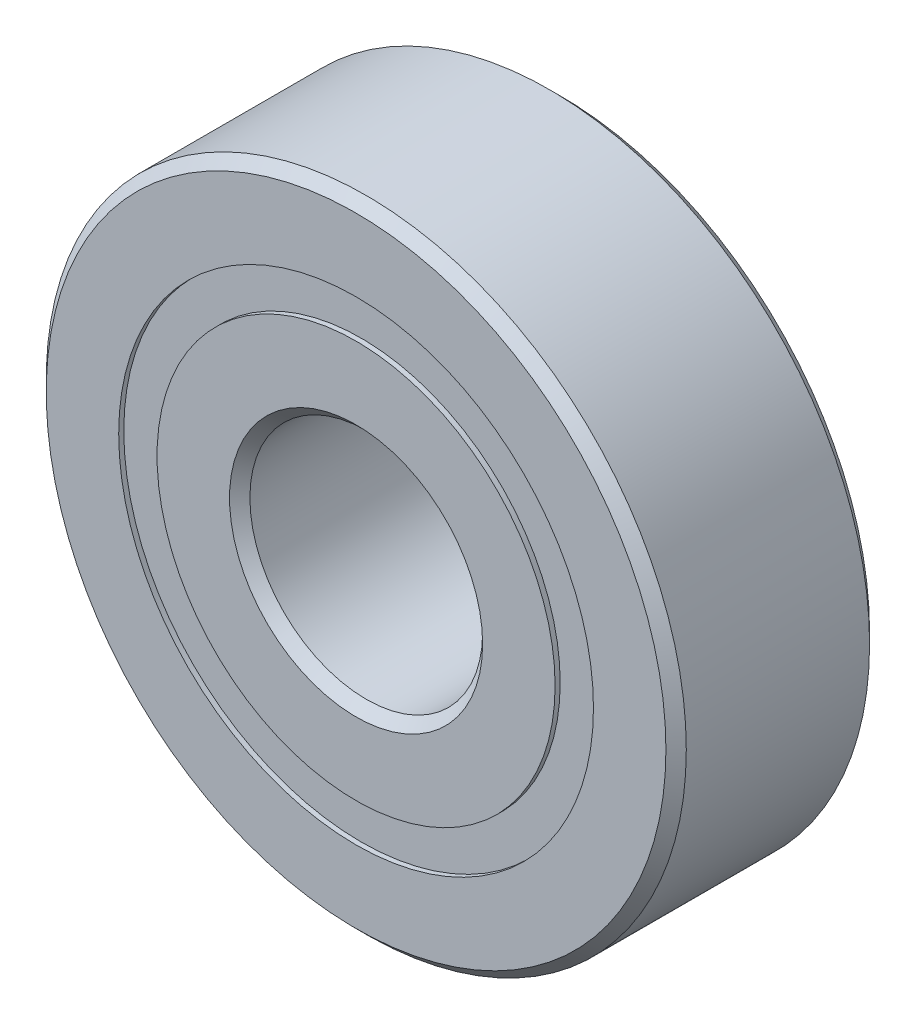
ISO-10303-21;
HEADER;
FILE_DESCRIPTION(('STEP AP214'),'2;1');
FILE_NAME('part.step','',(''),(''),'','','');
FILE_SCHEMA(('AUTOMOTIVE_DESIGN { 1 0 10303 214 1 1 1 1 }'));
ENDSEC;
DATA;
#1=APPLICATION_CONTEXT('core data for automotive mechanical design processes');
#2=APPLICATION_PROTOCOL_DEFINITION('international standard','automotive_design',2000,#1);
#3=PRODUCT_CONTEXT('',#1,'mechanical');
#4=PRODUCT('Part','Part','',(#3));
#5=PRODUCT_RELATED_PRODUCT_CATEGORY('part','',(#4));
#6=PRODUCT_DEFINITION_FORMATION('','',#4);
#7=PRODUCT_DEFINITION_CONTEXT('part definition',#1,'design');
#8=PRODUCT_DEFINITION('design','',#6,#7);
#9=PRODUCT_DEFINITION_SHAPE('','',#8);
#10=(LENGTH_UNIT() NAMED_UNIT(*) SI_UNIT(.MILLI.,.METRE.));
#11=(NAMED_UNIT(*) PLANE_ANGLE_UNIT() SI_UNIT($,.RADIAN.));
#12=(NAMED_UNIT(*) SI_UNIT($,.STERADIAN.) SOLID_ANGLE_UNIT());
#13=UNCERTAINTY_MEASURE_WITH_UNIT(LENGTH_MEASURE(1.E-05),#10,'distance_accuracy_value','');
#14=(GEOMETRIC_REPRESENTATION_CONTEXT(3) GLOBAL_UNCERTAINTY_ASSIGNED_CONTEXT((#13)) GLOBAL_UNIT_ASSIGNED_CONTEXT((#10,
#11,#12)) REPRESENTATION_CONTEXT('',''));
#15=CARTESIAN_POINT('',(0.,0.,0.));
#16=DIRECTION('',(0.,0.,1.));
#17=DIRECTION('',(1.,0.,0.));
#18=AXIS2_PLACEMENT_3D('',#15,#16,#17);
#19=CARTESIAN_POINT('',(0.,8.15934065934066,-3.325));
#20=DIRECTION('',(0.,0.,1.));
#21=DIRECTION('',(1.,0.,0.));
#22=AXIS2_PLACEMENT_3D('',#19,#20,#21);
#23=PLANE('',#22);
#24=CARTESIAN_POINT('',(0.,0.,-3.325));
#25=DIRECTION('',(0.,0.,1.));
#26=DIRECTION('',(1.,0.,0.));
#27=AXIS2_PLACEMENT_3D('',#24,#25,#26);
#28=CIRCLE('',#27,8.15934065934066);
#29=CARTESIAN_POINT('',(8.15934065934066,0.,-3.325));
#30=VERTEX_POINT('',#29);
#31=EDGE_CURVE('E58',#30,#30,#28,.T.);
#32=ORIENTED_EDGE('',*,*,#31,.F.);
#33=EDGE_LOOP('',(#32));
#34=FACE_BOUND('',#33,.T.);
#35=CARTESIAN_POINT('',(0.,0.,-3.325));
#36=DIRECTION('',(0.,0.,1.));
#37=DIRECTION('',(1.,0.,0.));
#38=AXIS2_PLACEMENT_3D('',#35,#36,#37);
#39=CIRCLE('',#38,6.84065934065934);
#40=CARTESIAN_POINT('',(6.84065934065934,0.,-3.325));
#41=VERTEX_POINT('',#40);
#42=EDGE_CURVE('E11',#41,#41,#39,.T.);
#43=ORIENTED_EDGE('',*,*,#42,.T.);
#44=EDGE_LOOP('',(#43));
#45=FACE_BOUND('',#44,.T.);
#46=ADVANCED_FACE('F44',(#34,#45),#23,.F.);
#47=CARTESIAN_POINT('',(0.,0.,3.5));
#48=DIRECTION('',(0.,0.,1.));
#49=DIRECTION('',(1.,0.,0.));
#50=AXIS2_PLACEMENT_3D('',#47,#48,#49);
#51=CYLINDRICAL_SURFACE('',#50,6.84065934065934);
#52=ORIENTED_EDGE('',*,*,#42,.F.);
#53=EDGE_LOOP('',(#52));
#54=FACE_BOUND('',#53,.T.);
#55=CARTESIAN_POINT('',(0.,0.,-1.68952158656808));
#56=DIRECTION('',(0.,0.,1.));
#57=DIRECTION('',(1.,0.,0.));
#58=AXIS2_PLACEMENT_3D('',#55,#56,#57);
#59=CIRCLE('',#58,6.84065934065934);
#60=CARTESIAN_POINT('',(6.84065934065934,0.,-1.68952158656808));
#61=VERTEX_POINT('',#60);
#62=EDGE_CURVE('E50',#61,#61,#59,.T.);
#63=ORIENTED_EDGE('',*,*,#62,.T.);
#64=EDGE_LOOP('',(#63));
#65=FACE_BOUND('',#64,.T.);
#66=ADVANCED_FACE('F67',(#54,#65),#51,.F.);
#67=CARTESIAN_POINT('',(0.,8.15934065934066,-1.68952158656808));
#68=DIRECTION('',(0.,0.,-1.));
#69=DIRECTION('',(-1.,0.,0.));
#70=AXIS2_PLACEMENT_3D('',#67,#68,#69);
#71=PLANE('',#70);
#72=ORIENTED_EDGE('',*,*,#62,.F.);
#73=EDGE_LOOP('',(#72));
#74=FACE_BOUND('',#73,.T.);
#75=CARTESIAN_POINT('',(0.,0.,-1.68952158656808));
#76=DIRECTION('',(0.,0.,1.));
#77=DIRECTION('',(1.,0.,0.));
#78=AXIS2_PLACEMENT_3D('',#75,#76,#77);
#79=CIRCLE('',#78,8.15934065934066);
#80=CARTESIAN_POINT('',(8.15934065934066,0.,-1.68952158656808));
#81=VERTEX_POINT('',#80);
#82=EDGE_CURVE('E54',#81,#81,#79,.T.);
#83=ORIENTED_EDGE('',*,*,#82,.T.);
#84=EDGE_LOOP('',(#83));
#85=FACE_BOUND('',#84,.T.);
#86=ADVANCED_FACE('F71',(#74,#85),#71,.F.);
#87=CARTESIAN_POINT('',(0.,0.,3.5));
#88=DIRECTION('',(0.,0.,1.));
#89=DIRECTION('',(1.,0.,0.));
#90=AXIS2_PLACEMENT_3D('',#87,#88,#89);
#91=CYLINDRICAL_SURFACE('',#90,8.15934065934066);
#92=ORIENTED_EDGE('',*,*,#82,.F.);
#93=EDGE_LOOP('',(#92));
#94=FACE_BOUND('',#93,.T.);
#95=ORIENTED_EDGE('',*,*,#31,.T.);
#96=EDGE_LOOP('',(#95));
#97=FACE_BOUND('',#96,.T.);
#98=ADVANCED_FACE('F64',(#94,#97),#91,.T.);
#99=CLOSED_SHELL('',(#46,#66,#86,#98));
#100=MANIFOLD_SOLID_BREP('B2',#99);
#101=CARTESIAN_POINT('',(0.,8.15934065934066,3.325));
#102=DIRECTION('',(0.,0.,-1.));
#103=DIRECTION('',(-1.,0.,0.));
#104=AXIS2_PLACEMENT_3D('',#101,#102,#103);
#105=PLANE('',#104);
#106=CARTESIAN_POINT('',(0.,0.,3.325));
#107=DIRECTION('',(0.,0.,1.));
#108=DIRECTION('',(1.,0.,0.));
#109=AXIS2_PLACEMENT_3D('',#106,#107,#108);
#110=CIRCLE('',#109,6.84065934065934);
#111=CARTESIAN_POINT('',(6.84065934065934,0.,3.325));
#112=VERTEX_POINT('',#111);
#113=EDGE_CURVE('E43',#112,#112,#110,.T.);
#114=ORIENTED_EDGE('',*,*,#113,.F.);
#115=EDGE_LOOP('',(#114));
#116=FACE_BOUND('',#115,.T.);
#117=CARTESIAN_POINT('',(0.,0.,3.325));
#118=DIRECTION('',(0.,0.,1.));
#119=DIRECTION('',(1.,0.,0.));
#120=AXIS2_PLACEMENT_3D('',#117,#118,#119);
#121=CIRCLE('',#120,8.15934065934066);
#122=CARTESIAN_POINT('',(8.15934065934066,0.,3.325));
#123=VERTEX_POINT('',#122);
#124=EDGE_CURVE('E126',#123,#123,#121,.T.);
#125=ORIENTED_EDGE('',*,*,#124,.T.);
#126=EDGE_LOOP('',(#125));
#127=FACE_BOUND('',#126,.T.);
#128=ADVANCED_FACE('F112',(#116,#127),#105,.F.);
#129=CARTESIAN_POINT('',(0.,0.,3.5));
#130=DIRECTION('',(0.,0.,1.));
#131=DIRECTION('',(1.,0.,0.));
#132=AXIS2_PLACEMENT_3D('',#129,#130,#131);
#133=CYLINDRICAL_SURFACE('',#132,6.84065934065934);
#134=CARTESIAN_POINT('',(0.,0.,1.68952158656808));
#135=DIRECTION('',(0.,0.,1.));
#136=DIRECTION('',(1.,0.,0.));
#137=AXIS2_PLACEMENT_3D('',#134,#135,#136);
#138=CIRCLE('',#137,6.84065934065934);
#139=CARTESIAN_POINT('',(6.84065934065934,0.,1.68952158656808));
#140=VERTEX_POINT('',#139);
#141=EDGE_CURVE('E118',#140,#140,#138,.T.);
#142=ORIENTED_EDGE('',*,*,#141,.F.);
#143=EDGE_LOOP('',(#142));
#144=FACE_BOUND('',#143,.T.);
#145=ORIENTED_EDGE('',*,*,#113,.T.);
#146=EDGE_LOOP('',(#145));
#147=FACE_BOUND('',#146,.T.);
#148=ADVANCED_FACE('F141',(#144,#147),#133,.F.);
#149=CARTESIAN_POINT('',(0.,8.15934065934066,1.68952158656808));
#150=DIRECTION('',(0.,0.,1.));
#151=DIRECTION('',(1.,0.,0.));
#152=AXIS2_PLACEMENT_3D('',#149,#150,#151);
#153=PLANE('',#152);
#154=CARTESIAN_POINT('',(0.,0.,1.68952158656808));
#155=DIRECTION('',(0.,0.,1.));
#156=DIRECTION('',(1.,0.,0.));
#157=AXIS2_PLACEMENT_3D('',#154,#155,#156);
#158=CIRCLE('',#157,8.15934065934066);
#159=CARTESIAN_POINT('',(8.15934065934066,0.,1.68952158656808));
#160=VERTEX_POINT('',#159);
#161=EDGE_CURVE('E122',#160,#160,#158,.T.);
#162=ORIENTED_EDGE('',*,*,#161,.F.);
#163=EDGE_LOOP('',(#162));
#164=FACE_BOUND('',#163,.T.);
#165=ORIENTED_EDGE('',*,*,#141,.T.);
#166=EDGE_LOOP('',(#165));
#167=FACE_BOUND('',#166,.T.);
#168=ADVANCED_FACE('F136',(#164,#167),#153,.F.);
#169=CARTESIAN_POINT('',(0.,0.,3.5));
#170=DIRECTION('',(0.,0.,1.));
#171=DIRECTION('',(1.,0.,0.));
#172=AXIS2_PLACEMENT_3D('',#169,#170,#171);
#173=CYLINDRICAL_SURFACE('',#172,8.15934065934066);
#174=ORIENTED_EDGE('',*,*,#124,.F.);
#175=EDGE_LOOP('',(#174));
#176=FACE_BOUND('',#175,.T.);
#177=ORIENTED_EDGE('',*,*,#161,.T.);
#178=EDGE_LOOP('',(#177));
#179=FACE_BOUND('',#178,.T.);
#180=ADVANCED_FACE('F133',(#176,#179),#173,.T.);
#181=CLOSED_SHELL('',(#128,#148,#168,#180));
#182=MANIFOLD_SOLID_BREP('B6',#181);
#183=CARTESIAN_POINT('',(-3.74999999999992,6.49519052838334,0.));
#184=DIRECTION('',(0.,0.,1.));
#185=DIRECTION('',(-0.499999999999989,0.866025403784445,0.));
#186=AXIS2_PLACEMENT_3D('',#183,#184,#185);
#187=SPHERICAL_SURFACE('',#186,1.68952158656808);
#188=CARTESIAN_POINT('',(-3.74999999999992,6.49519052838334,1.68952158656808));
#189=VERTEX_POINT('',#188);
#190=VERTEX_LOOP('',#189);
#191=FACE_BOUND('',#190,.T.);
#192=ADVANCED_FACE('F180',(#191),#187,.T.);
#193=CLOSED_SHELL('',(#192));
#194=MANIFOLD_SOLID_BREP('B38',#193);
#195=CARTESIAN_POINT('',(-6.49519052838325,3.75000000000008,0.));
#196=DIRECTION('',(0.,0.,1.));
#197=DIRECTION('',(-0.866025403784433,0.50000000000001,0.));
#198=AXIS2_PLACEMENT_3D('',#195,#196,#197);
#199=SPHERICAL_SURFACE('',#198,1.68952158656808);
#200=CARTESIAN_POINT('',(-6.49519052838325,3.75000000000008,1.68952158656808));
#201=VERTEX_POINT('',#200);
#202=VERTEX_LOOP('',#201);
#203=FACE_BOUND('',#202,.T.);
#204=ADVANCED_FACE('F201',(#203),#199,.T.);
#205=CLOSED_SHELL('',(#204));
#206=MANIFOLD_SOLID_BREP('B108',#205);
#207=CARTESIAN_POINT('',(-7.5,0.,0.));
#208=DIRECTION('',(0.,0.,1.));
#209=DIRECTION('',(-1.,0.,0.));
#210=AXIS2_PLACEMENT_3D('',#207,#208,#209);
#211=SPHERICAL_SURFACE('',#210,1.68952158656808);
#212=CARTESIAN_POINT('',(-7.5,0.,1.68952158656808));
#213=VERTEX_POINT('',#212);
#214=VERTEX_LOOP('',#213);
#215=FACE_BOUND('',#214,.T.);
#216=ADVANCED_FACE('F222',(#215),#211,.T.);
#217=CLOSED_SHELL('',(#216));
#218=MANIFOLD_SOLID_BREP('B176',#217);
#219=CARTESIAN_POINT('',(-6.49519052838332,-3.74999999999994,0.));
#220=DIRECTION('',(0.,0.,1.));
#221=DIRECTION('',(-0.866025403784443,-0.499999999999992,0.));
#222=AXIS2_PLACEMENT_3D('',#219,#220,#221);
#223=SPHERICAL_SURFACE('',#222,1.68952158656808);
#224=CARTESIAN_POINT('',(-6.49519052838332,-3.74999999999994,1.68952158656808));
#225=VERTEX_POINT('',#224);
#226=VERTEX_LOOP('',#225);
#227=FACE_BOUND('',#226,.T.);
#228=ADVANCED_FACE('F243',(#227),#223,.T.);
#229=CLOSED_SHELL('',(#228));
#230=MANIFOLD_SOLID_BREP('B197',#229);
#231=CARTESIAN_POINT('',(-3.75000000000005,-6.49519052838326,0.));
#232=DIRECTION('',(0.,0.,1.));
#233=DIRECTION('',(-0.500000000000007,-0.866025403784435,0.));
#234=AXIS2_PLACEMENT_3D('',#231,#232,#233);
#235=SPHERICAL_SURFACE('',#234,1.68952158656808);
#236=CARTESIAN_POINT('',(-3.75000000000005,-6.49519052838326,1.68952158656808));
#237=VERTEX_POINT('',#236);
#238=VERTEX_LOOP('',#237);
#239=FACE_BOUND('',#238,.T.);
#240=ADVANCED_FACE('F264',(#239),#235,.T.);
#241=CLOSED_SHELL('',(#240));
#242=MANIFOLD_SOLID_BREP('B218',#241);
#243=CARTESIAN_POINT('',(0.,-7.5,0.));
#244=DIRECTION('',(0.,0.,1.));
#245=DIRECTION('',(0.,-1.,0.));
#246=AXIS2_PLACEMENT_3D('',#243,#244,#245);
#247=SPHERICAL_SURFACE('',#246,1.68952158656808);
#248=CARTESIAN_POINT('',(0.,-7.5,1.68952158656808));
#249=VERTEX_POINT('',#248);
#250=VERTEX_LOOP('',#249);
#251=FACE_BOUND('',#250,.T.);
#252=ADVANCED_FACE('F285',(#251),#247,.T.);
#253=CLOSED_SHELL('',(#252));
#254=MANIFOLD_SOLID_BREP('B239',#253);
#255=CARTESIAN_POINT('',(3.74999999999996,-6.49519052838331,0.));
#256=DIRECTION('',(0.,0.,1.));
#257=DIRECTION('',(0.499999999999995,-0.866025403784442,0.));
#258=AXIS2_PLACEMENT_3D('',#255,#256,#257);
#259=SPHERICAL_SURFACE('',#258,1.68952158656808);
#260=CARTESIAN_POINT('',(3.74999999999996,-6.49519052838331,1.68952158656808));
#261=VERTEX_POINT('',#260);
#262=VERTEX_LOOP('',#261);
#263=FACE_BOUND('',#262,.T.);
#264=ADVANCED_FACE('F306',(#263),#259,.T.);
#265=CLOSED_SHELL('',(#264));
#266=MANIFOLD_SOLID_BREP('B260',#265);
#267=CARTESIAN_POINT('',(6.49519052838327,-3.75000000000003,0.));
#268=DIRECTION('',(0.,0.,1.));
#269=DIRECTION('',(0.866025403784436,-0.500000000000004,0.));
#270=AXIS2_PLACEMENT_3D('',#267,#268,#269);
#271=SPHERICAL_SURFACE('',#270,1.68952158656808);
#272=CARTESIAN_POINT('',(6.49519052838327,-3.75000000000003,1.68952158656808));
#273=VERTEX_POINT('',#272);
#274=VERTEX_LOOP('',#273);
#275=FACE_BOUND('',#274,.T.);
#276=ADVANCED_FACE('F327',(#275),#271,.T.);
#277=CLOSED_SHELL('',(#276));
#278=MANIFOLD_SOLID_BREP('B281',#277);
#279=CARTESIAN_POINT('',(7.5,0.,0.));
#280=DIRECTION('',(0.,0.,1.));
#281=DIRECTION('',(1.,0.,0.));
#282=AXIS2_PLACEMENT_3D('',#279,#280,#281);
#283=SPHERICAL_SURFACE('',#282,1.68952158656808);
#284=CARTESIAN_POINT('',(7.5,0.,1.68952158656808));
#285=VERTEX_POINT('',#284);
#286=VERTEX_LOOP('',#285);
#287=FACE_BOUND('',#286,.T.);
#288=ADVANCED_FACE('F348',(#287),#283,.T.);
#289=CLOSED_SHELL('',(#288));
#290=MANIFOLD_SOLID_BREP('B302',#289);
#291=CARTESIAN_POINT('',(6.4951905283833,3.74999999999998,0.));
#292=DIRECTION('',(0.,0.,1.));
#293=DIRECTION('',(0.86602540378444,0.499999999999998,0.));
#294=AXIS2_PLACEMENT_3D('',#291,#292,#293);
#295=SPHERICAL_SURFACE('',#294,1.68952158656808);
#296=CARTESIAN_POINT('',(6.4951905283833,3.74999999999998,1.68952158656808));
#297=VERTEX_POINT('',#296);
#298=VERTEX_LOOP('',#297);
#299=FACE_BOUND('',#298,.T.);
#300=ADVANCED_FACE('F369',(#299),#295,.T.);
#301=CLOSED_SHELL('',(#300));
#302=MANIFOLD_SOLID_BREP('B323',#301);
#303=CARTESIAN_POINT('',(3.75000000000001,6.49519052838328,0.));
#304=DIRECTION('',(0.,0.,1.));
#305=DIRECTION('',(0.500000000000001,0.866025403784438,0.));
#306=AXIS2_PLACEMENT_3D('',#303,#304,#305);
#307=SPHERICAL_SURFACE('',#306,1.68952158656808);
#308=CARTESIAN_POINT('',(3.75000000000001,6.49519052838328,1.68952158656808));
#309=VERTEX_POINT('',#308);
#310=VERTEX_LOOP('',#309);
#311=FACE_BOUND('',#310,.T.);
#312=ADVANCED_FACE('F390',(#311),#307,.T.);
#313=CLOSED_SHELL('',(#312));
#314=MANIFOLD_SOLID_BREP('B344',#313);
#315=CARTESIAN_POINT('',(0.,7.5,0.));
#316=DIRECTION('',(0.,0.,1.));
#317=DIRECTION('',(0.,1.,0.));
#318=AXIS2_PLACEMENT_3D('',#315,#316,#317);
#319=SPHERICAL_SURFACE('',#318,1.68952158656808);
#320=CARTESIAN_POINT('',(0.,7.5,1.68952158656808));
#321=VERTEX_POINT('',#320);
#322=VERTEX_LOOP('',#321);
#323=FACE_BOUND('',#322,.T.);
#324=ADVANCED_FACE('F413',(#323),#319,.T.);
#325=CLOSED_SHELL('',(#324));
#326=MANIFOLD_SOLID_BREP('B365',#325);
#327=CARTESIAN_POINT('',(0.,6.84065934065934,3.5));
#328=DIRECTION('',(0.,0.,-1.));
#329=DIRECTION('',(-1.,0.,0.));
#330=AXIS2_PLACEMENT_3D('',#327,#328,#329);
#331=PLANE('',#330);
#332=CARTESIAN_POINT('',(0.,0.,3.5));
#333=DIRECTION('',(0.,0.,1.));
#334=DIRECTION('',(1.,0.,0.));
#335=AXIS2_PLACEMENT_3D('',#332,#333,#334);
#336=CIRCLE('',#335,4.35);
#337=CARTESIAN_POINT('',(4.35,0.,3.5));
#338=VERTEX_POINT('',#337);
#339=EDGE_CURVE('E461',#338,#338,#336,.T.);
#340=ORIENTED_EDGE('',*,*,#339,.F.);
#341=EDGE_LOOP('',(#340));
#342=FACE_BOUND('',#341,.T.);
#343=CARTESIAN_POINT('',(0.,0.,3.5));
#344=DIRECTION('',(0.,0.,1.));
#345=DIRECTION('',(1.,0.,0.));
#346=AXIS2_PLACEMENT_3D('',#343,#344,#345);
#347=CIRCLE('',#346,6.84065934065934);
#348=CARTESIAN_POINT('',(6.84065934065934,0.,3.5));
#349=VERTEX_POINT('',#348);
#350=EDGE_CURVE('E412',#349,#349,#347,.T.);
#351=ORIENTED_EDGE('',*,*,#350,.T.);
#352=EDGE_LOOP('',(#351));
#353=FACE_BOUND('',#352,.T.);
#354=ADVANCED_FACE('F433',(#342,#353),#331,.F.);
#355=CARTESIAN_POINT('',(0.,0.,3.5));
#356=DIRECTION('',(0.,0.,1.));
#357=DIRECTION('',(1.,0.,0.));
#358=AXIS2_PLACEMENT_3D('',#355,#356,#357);
#359=CYLINDRICAL_SURFACE('',#358,6.84065934065934);
#360=ORIENTED_EDGE('',*,*,#350,.F.);
#361=EDGE_LOOP('',(#360));
#362=FACE_BOUND('',#361,.T.);
#363=CARTESIAN_POINT('',(0.,0.,1.55555555555556));
#364=DIRECTION('',(0.,0.,1.));
#365=DIRECTION('',(1.,0.,0.));
#366=AXIS2_PLACEMENT_3D('',#363,#364,#365);
#367=CIRCLE('',#366,6.84065934065934);
#368=CARTESIAN_POINT('',(6.84065934065934,0.,1.55555555555556));
#369=VERTEX_POINT('',#368);
#370=EDGE_CURVE('E439',#369,#369,#367,.T.);
#371=ORIENTED_EDGE('',*,*,#370,.T.);
#372=EDGE_LOOP('',(#371));
#373=FACE_BOUND('',#372,.T.);
#374=ADVANCED_FACE('F468',(#362,#373),#359,.T.);
#375=CARTESIAN_POINT('',(0.,0.,0.));
#376=DIRECTION('',(0.,0.,1.));
#377=DIRECTION('',(1.,0.,0.));
#378=AXIS2_PLACEMENT_3D('',#375,#376,#377);
#379=TOROIDAL_SURFACE('',#378,7.49999999999999,1.68952158656808);
#380=ORIENTED_EDGE('',*,*,#370,.F.);
#381=EDGE_LOOP('',(#380));
#382=FACE_BOUND('',#381,.T.);
#383=CARTESIAN_POINT('',(0.,0.,-1.55555555555556));
#384=DIRECTION('',(0.,0.,1.));
#385=DIRECTION('',(1.,0.,0.));
#386=AXIS2_PLACEMENT_3D('',#383,#384,#385);
#387=CIRCLE('',#386,6.84065934065934);
#388=CARTESIAN_POINT('',(6.84065934065934,0.,-1.55555555555556));
#389=VERTEX_POINT('',#388);
#390=EDGE_CURVE('E443',#389,#389,#387,.T.);
#391=ORIENTED_EDGE('',*,*,#390,.T.);
#392=EDGE_LOOP('',(#391));
#393=FACE_BOUND('',#392,.T.);
#394=ADVANCED_FACE('F472',(#382,#393),#379,.F.);
#395=CARTESIAN_POINT('',(0.,0.,3.5));
#396=DIRECTION('',(0.,0.,1.));
#397=DIRECTION('',(1.,0.,0.));
#398=AXIS2_PLACEMENT_3D('',#395,#396,#397);
#399=CYLINDRICAL_SURFACE('',#398,6.84065934065934);
#400=ORIENTED_EDGE('',*,*,#390,.F.);
#401=EDGE_LOOP('',(#400));
#402=FACE_BOUND('',#401,.T.);
#403=CARTESIAN_POINT('',(0.,0.,-3.5));
#404=DIRECTION('',(0.,0.,1.));
#405=DIRECTION('',(1.,0.,0.));
#406=AXIS2_PLACEMENT_3D('',#403,#404,#405);
#407=CIRCLE('',#406,6.84065934065934);
#408=CARTESIAN_POINT('',(6.84065934065934,0.,-3.5));
#409=VERTEX_POINT('',#408);
#410=EDGE_CURVE('E447',#409,#409,#407,.T.);
#411=ORIENTED_EDGE('',*,*,#410,.T.);
#412=EDGE_LOOP('',(#411));
#413=FACE_BOUND('',#412,.T.);
#414=ADVANCED_FACE('F477',(#402,#413),#399,.T.);
#415=CARTESIAN_POINT('',(0.,4.35,-3.5));
#416=DIRECTION('',(0.,0.,1.));
#417=DIRECTION('',(1.,0.,0.));
#418=AXIS2_PLACEMENT_3D('',#415,#416,#417);
#419=PLANE('',#418);
#420=ORIENTED_EDGE('',*,*,#410,.F.);
#421=EDGE_LOOP('',(#420));
#422=FACE_BOUND('',#421,.T.);
#423=CARTESIAN_POINT('',(0.,0.,-3.5));
#424=DIRECTION('',(0.,0.,1.));
#425=DIRECTION('',(1.,0.,0.));
#426=AXIS2_PLACEMENT_3D('',#423,#424,#425);
#427=CIRCLE('',#426,4.35);
#428=CARTESIAN_POINT('',(4.35,0.,-3.5));
#429=VERTEX_POINT('',#428);
#430=EDGE_CURVE('E452',#429,#429,#427,.T.);
#431=ORIENTED_EDGE('',*,*,#430,.T.);
#432=EDGE_LOOP('',(#431));
#433=FACE_BOUND('',#432,.T.);
#434=ADVANCED_FACE('F483',(#422,#433),#419,.F.);
#435=CARTESIAN_POINT('',(0.,0.,-3.15));
#436=DIRECTION('',(0.,0.,-1.));
#437=DIRECTION('',(-1.,0.,0.));
#438=AXIS2_PLACEMENT_3D('',#435,#436,#437);
#439=CONICAL_SURFACE('',#438,4.,0.785398163397451);
#440=ORIENTED_EDGE('',*,*,#430,.F.);
#441=EDGE_LOOP('',(#440));
#442=FACE_BOUND('',#441,.T.);
#443=CARTESIAN_POINT('',(0.,0.,-3.15));
#444=DIRECTION('',(0.,0.,1.));
#445=DIRECTION('',(1.,0.,0.));
#446=AXIS2_PLACEMENT_3D('',#443,#444,#445);
#447=CIRCLE('',#446,4.);
#448=CARTESIAN_POINT('',(4.,0.,-3.15));
#449=VERTEX_POINT('',#448);
#450=EDGE_CURVE('E455',#449,#449,#447,.T.);
#451=ORIENTED_EDGE('',*,*,#450,.T.);
#452=EDGE_LOOP('',(#451));
#453=FACE_BOUND('',#452,.T.);
#454=ADVANCED_FACE('F487',(#442,#453),#439,.F.);
#455=CARTESIAN_POINT('',(0.,0.,3.5));
#456=DIRECTION('',(0.,0.,1.));
#457=DIRECTION('',(1.,0.,0.));
#458=AXIS2_PLACEMENT_3D('',#455,#456,#457);
#459=CYLINDRICAL_SURFACE('',#458,4.);
#460=ORIENTED_EDGE('',*,*,#450,.F.);
#461=EDGE_LOOP('',(#460));
#462=FACE_BOUND('',#461,.T.);
#463=CARTESIAN_POINT('',(0.,0.,3.15));
#464=DIRECTION('',(0.,0.,1.));
#465=DIRECTION('',(1.,0.,0.));
#466=AXIS2_PLACEMENT_3D('',#463,#464,#465);
#467=CIRCLE('',#466,4.);
#468=CARTESIAN_POINT('',(4.,0.,3.15));
#469=VERTEX_POINT('',#468);
#470=EDGE_CURVE('E458',#469,#469,#467,.T.);
#471=ORIENTED_EDGE('',*,*,#470,.T.);
#472=EDGE_LOOP('',(#471));
#473=FACE_BOUND('',#472,.T.);
#474=ADVANCED_FACE('F491',(#462,#473),#459,.F.);
#475=CARTESIAN_POINT('',(0.,0.,3.5));
#476=DIRECTION('',(0.,0.,1.));
#477=DIRECTION('',(1.,0.,0.));
#478=AXIS2_PLACEMENT_3D('',#475,#476,#477);
#479=CONICAL_SURFACE('',#478,4.35,0.785398163397447);
#480=ORIENTED_EDGE('',*,*,#470,.F.);
#481=EDGE_LOOP('',(#480));
#482=FACE_BOUND('',#481,.T.);
#483=ORIENTED_EDGE('',*,*,#339,.T.);
#484=EDGE_LOOP('',(#483));
#485=FACE_BOUND('',#484,.T.);
#486=ADVANCED_FACE('F465',(#482,#485),#479,.F.);
#487=CLOSED_SHELL('',(#354,#374,#394,#414,#434,#454,#474,#486));
#488=MANIFOLD_SOLID_BREP('B386',#487);
#489=CARTESIAN_POINT('',(0.,0.,3.15));
#490=DIRECTION('',(0.,0.,-1.));
#491=DIRECTION('',(-1.,0.,0.));
#492=AXIS2_PLACEMENT_3D('',#489,#490,#491);
#493=CONICAL_SURFACE('',#492,11.,0.78539816339745);
#494=CARTESIAN_POINT('',(0.,0.,3.5));
#495=DIRECTION('',(0.,0.,1.));
#496=DIRECTION('',(1.,0.,0.));
#497=AXIS2_PLACEMENT_3D('',#494,#495,#496);
#498=CIRCLE('',#497,10.65);
#499=CARTESIAN_POINT('',(10.65,0.,3.5));
#500=VERTEX_POINT('',#499);
#501=EDGE_CURVE('E583',#500,#500,#498,.T.);
#502=ORIENTED_EDGE('',*,*,#501,.F.);
#503=EDGE_LOOP('',(#502));
#504=FACE_BOUND('',#503,.T.);
#505=CARTESIAN_POINT('',(0.,0.,3.15));
#506=DIRECTION('',(0.,0.,1.));
#507=DIRECTION('',(1.,0.,0.));
#508=AXIS2_PLACEMENT_3D('',#505,#506,#507);
#509=CIRCLE('',#508,11.);
#510=CARTESIAN_POINT('',(11.,0.,3.15));
#511=VERTEX_POINT('',#510);
#512=EDGE_CURVE('E432',#511,#511,#509,.T.);
#513=ORIENTED_EDGE('',*,*,#512,.T.);
#514=EDGE_LOOP('',(#513));
#515=FACE_BOUND('',#514,.T.);
#516=ADVANCED_FACE('F555',(#504,#515),#493,.T.);
#517=CARTESIAN_POINT('',(0.,0.,3.5));
#518=DIRECTION('',(0.,0.,1.));
#519=DIRECTION('',(1.,0.,0.));
#520=AXIS2_PLACEMENT_3D('',#517,#518,#519);
#521=CYLINDRICAL_SURFACE('',#520,11.);
#522=ORIENTED_EDGE('',*,*,#512,.F.);
#523=EDGE_LOOP('',(#522));
#524=FACE_BOUND('',#523,.T.);
#525=CARTESIAN_POINT('',(0.,0.,-3.15));
#526=DIRECTION('',(0.,0.,1.));
#527=DIRECTION('',(1.,0.,0.));
#528=AXIS2_PLACEMENT_3D('',#525,#526,#527);
#529=CIRCLE('',#528,11.);
#530=CARTESIAN_POINT('',(11.,0.,-3.15));
#531=VERTEX_POINT('',#530);
#532=EDGE_CURVE('E561',#531,#531,#529,.T.);
#533=ORIENTED_EDGE('',*,*,#532,.T.);
#534=EDGE_LOOP('',(#533));
#535=FACE_BOUND('',#534,.T.);
#536=ADVANCED_FACE('F590',(#524,#535),#521,.T.);
#537=CARTESIAN_POINT('',(0.,0.,-3.5));
#538=DIRECTION('',(0.,0.,1.));
#539=DIRECTION('',(1.,0.,0.));
#540=AXIS2_PLACEMENT_3D('',#537,#538,#539);
#541=CONICAL_SURFACE('',#540,10.65,0.785398163397448);
#542=ORIENTED_EDGE('',*,*,#532,.F.);
#543=EDGE_LOOP('',(#542));
#544=FACE_BOUND('',#543,.T.);
#545=CARTESIAN_POINT('',(0.,0.,-3.5));
#546=DIRECTION('',(0.,0.,1.));
#547=DIRECTION('',(1.,0.,0.));
#548=AXIS2_PLACEMENT_3D('',#545,#546,#547);
#549=CIRCLE('',#548,10.65);
#550=CARTESIAN_POINT('',(10.65,0.,-3.5));
#551=VERTEX_POINT('',#550);
#552=EDGE_CURVE('E565',#551,#551,#549,.T.);
#553=ORIENTED_EDGE('',*,*,#552,.T.);
#554=EDGE_LOOP('',(#553));
#555=FACE_BOUND('',#554,.T.);
#556=ADVANCED_FACE('F594',(#544,#555),#541,.T.);
#557=CARTESIAN_POINT('',(0.,10.65,-3.5));
#558=DIRECTION('',(0.,0.,1.));
#559=DIRECTION('',(1.,0.,0.));
#560=AXIS2_PLACEMENT_3D('',#557,#558,#559);
#561=PLANE('',#560);
#562=ORIENTED_EDGE('',*,*,#552,.F.);
#563=EDGE_LOOP('',(#562));
#564=FACE_BOUND('',#563,.T.);
#565=CARTESIAN_POINT('',(0.,0.,-3.5));
#566=DIRECTION('',(0.,0.,1.));
#567=DIRECTION('',(1.,0.,0.));
#568=AXIS2_PLACEMENT_3D('',#565,#566,#567);
#569=CIRCLE('',#568,8.15934065934066);
#570=CARTESIAN_POINT('',(8.15934065934066,0.,-3.5));
#571=VERTEX_POINT('',#570);
#572=EDGE_CURVE('E569',#571,#571,#569,.T.);
#573=ORIENTED_EDGE('',*,*,#572,.T.);
#574=EDGE_LOOP('',(#573));
#575=FACE_BOUND('',#574,.T.);
#576=ADVANCED_FACE('F599',(#564,#575),#561,.F.);
#577=CARTESIAN_POINT('',(0.,0.,3.5));
#578=DIRECTION('',(0.,0.,1.));
#579=DIRECTION('',(1.,0.,0.));
#580=AXIS2_PLACEMENT_3D('',#577,#578,#579);
#581=CYLINDRICAL_SURFACE('',#580,8.15934065934066);
#582=ORIENTED_EDGE('',*,*,#572,.F.);
#583=EDGE_LOOP('',(#582));
#584=FACE_BOUND('',#583,.T.);
#585=CARTESIAN_POINT('',(0.,0.,-1.55555555555556));
#586=DIRECTION('',(0.,0.,1.));
#587=DIRECTION('',(1.,0.,0.));
#588=AXIS2_PLACEMENT_3D('',#585,#586,#587);
#589=CIRCLE('',#588,8.15934065934066);
#590=CARTESIAN_POINT('',(8.15934065934066,0.,-1.55555555555556));
#591=VERTEX_POINT('',#590);
#592=EDGE_CURVE('E574',#591,#591,#589,.T.);
#593=ORIENTED_EDGE('',*,*,#592,.T.);
#594=EDGE_LOOP('',(#593));
#595=FACE_BOUND('',#594,.T.);
#596=ADVANCED_FACE('F605',(#584,#595),#581,.F.);
#597=CARTESIAN_POINT('',(0.,0.,0.));
#598=DIRECTION('',(0.,0.,1.));
#599=DIRECTION('',(1.,0.,0.));
#600=AXIS2_PLACEMENT_3D('',#597,#598,#599);
#601=TOROIDAL_SURFACE('',#600,7.5,1.68952158656808);
#602=ORIENTED_EDGE('',*,*,#592,.F.);
#603=EDGE_LOOP('',(#602));
#604=FACE_BOUND('',#603,.T.);
#605=CARTESIAN_POINT('',(0.,0.,1.55555555555556));
#606=DIRECTION('',(0.,0.,1.));
#607=DIRECTION('',(1.,0.,0.));
#608=AXIS2_PLACEMENT_3D('',#605,#606,#607);
#609=CIRCLE('',#608,8.15934065934066);
#610=CARTESIAN_POINT('',(8.15934065934066,0.,1.55555555555556));
#611=VERTEX_POINT('',#610);
#612=EDGE_CURVE('E577',#611,#611,#609,.T.);
#613=ORIENTED_EDGE('',*,*,#612,.T.);
#614=EDGE_LOOP('',(#613));
#615=FACE_BOUND('',#614,.T.);
#616=ADVANCED_FACE('F609',(#604,#615),#601,.F.);
#617=CARTESIAN_POINT('',(0.,0.,3.5));
#618=DIRECTION('',(0.,0.,1.));
#619=DIRECTION('',(1.,0.,0.));
#620=AXIS2_PLACEMENT_3D('',#617,#618,#619);
#621=CYLINDRICAL_SURFACE('',#620,8.15934065934066);
#622=ORIENTED_EDGE('',*,*,#612,.F.);
#623=EDGE_LOOP('',(#622));
#624=FACE_BOUND('',#623,.T.);
#625=CARTESIAN_POINT('',(0.,0.,3.5));
#626=DIRECTION('',(0.,0.,1.));
#627=DIRECTION('',(1.,0.,0.));
#628=AXIS2_PLACEMENT_3D('',#625,#626,#627);
#629=CIRCLE('',#628,8.15934065934066);
#630=CARTESIAN_POINT('',(8.15934065934066,0.,3.5));
#631=VERTEX_POINT('',#630);
#632=EDGE_CURVE('E580',#631,#631,#629,.T.);
#633=ORIENTED_EDGE('',*,*,#632,.T.);
#634=EDGE_LOOP('',(#633));
#635=FACE_BOUND('',#634,.T.);
#636=ADVANCED_FACE('F613',(#624,#635),#621,.F.);
#637=CARTESIAN_POINT('',(0.,10.65,3.5));
#638=DIRECTION('',(0.,0.,-1.));
#639=DIRECTION('',(-1.,0.,0.));
#640=AXIS2_PLACEMENT_3D('',#637,#638,#639);
#641=PLANE('',#640);
#642=ORIENTED_EDGE('',*,*,#632,.F.);
#643=EDGE_LOOP('',(#642));
#644=FACE_BOUND('',#643,.T.);
#645=ORIENTED_EDGE('',*,*,#501,.T.);
#646=EDGE_LOOP('',(#645));
#647=FACE_BOUND('',#646,.T.);
#648=ADVANCED_FACE('F587',(#644,#647),#641,.F.);
#649=CLOSED_SHELL('',(#516,#536,#556,#576,#596,#616,#636,#648));
#650=MANIFOLD_SOLID_BREP('B407',#649);
#651=ADVANCED_BREP_SHAPE_REPRESENTATION('',(#18,#100,#182,#194,#206,#218,#230,#242,#254,#266,
#278,#290,#302,#314,#326,#488,#650),#14);
#652=SHAPE_DEFINITION_REPRESENTATION(#9,#651);
ENDSEC;
END-ISO-10303-21;
